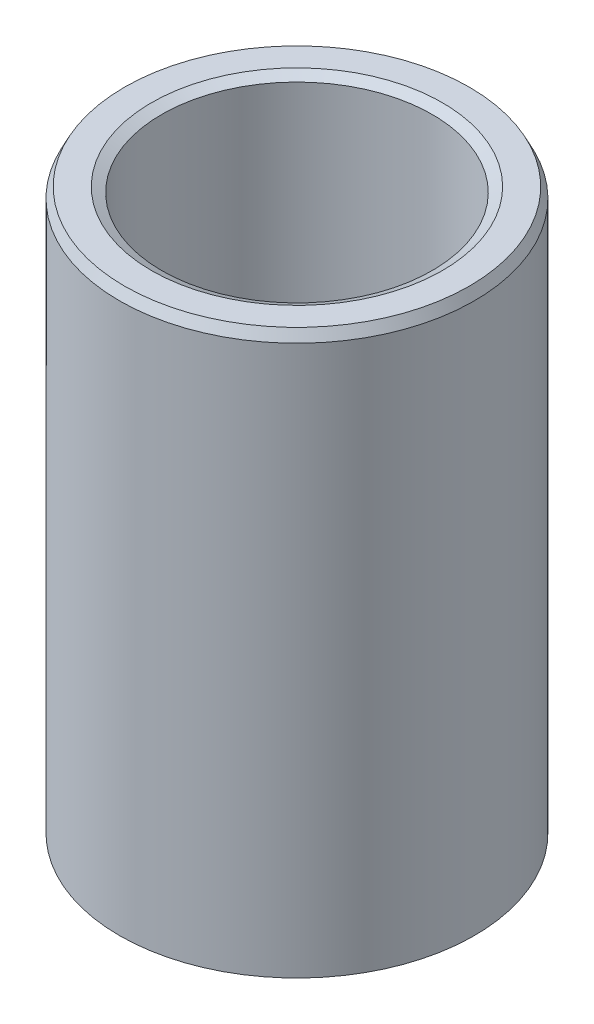
ISO-10303-21;
HEADER;
FILE_DESCRIPTION(('STEP AP214'),'2;1');
FILE_NAME('part.step','',(''),(''),'','','');
FILE_SCHEMA(('AUTOMOTIVE_DESIGN { 1 0 10303 214 1 1 1 1 }'));
ENDSEC;
DATA;
#1=APPLICATION_CONTEXT('core data for automotive mechanical design processes');
#2=APPLICATION_PROTOCOL_DEFINITION('international standard','automotive_design',2000,#1);
#3=PRODUCT_CONTEXT('',#1,'mechanical');
#4=PRODUCT('Part','Part','',(#3));
#5=PRODUCT_RELATED_PRODUCT_CATEGORY('part','',(#4));
#6=PRODUCT_DEFINITION_FORMATION('','',#4);
#7=PRODUCT_DEFINITION_CONTEXT('part definition',#1,'design');
#8=PRODUCT_DEFINITION('design','',#6,#7);
#9=PRODUCT_DEFINITION_SHAPE('','',#8);
#10=(LENGTH_UNIT() NAMED_UNIT(*) SI_UNIT(.MILLI.,.METRE.));
#11=(NAMED_UNIT(*) PLANE_ANGLE_UNIT() SI_UNIT($,.RADIAN.));
#12=(NAMED_UNIT(*) SI_UNIT($,.STERADIAN.) SOLID_ANGLE_UNIT());
#13=UNCERTAINTY_MEASURE_WITH_UNIT(LENGTH_MEASURE(1.E-05),#10,'distance_accuracy_value','');
#14=(GEOMETRIC_REPRESENTATION_CONTEXT(3) GLOBAL_UNCERTAINTY_ASSIGNED_CONTEXT((#13)) GLOBAL_UNIT_ASSIGNED_CONTEXT((#10,
#11,#12)) REPRESENTATION_CONTEXT('',''));
#15=CARTESIAN_POINT('',(0.,0.,0.));
#16=DIRECTION('',(0.,0.,1.));
#17=DIRECTION('',(1.,0.,0.));
#18=AXIS2_PLACEMENT_3D('',#15,#16,#17);
#19=CARTESIAN_POINT('',(0.,79.5943098667342,0.));
#20=DIRECTION('',(0.,-1.,0.));
#21=DIRECTION('',(0.,0.,-1.));
#22=AXIS2_PLACEMENT_3D('',#19,#20,#21);
#23=CYLINDRICAL_SURFACE('',#22,25.);
#24=CARTESIAN_POINT('',(0.,0.715759921933637,0.));
#25=DIRECTION('',(0.,1.,0.));
#26=DIRECTION('',(0.,0.,1.));
#27=AXIS2_PLACEMENT_3D('',#24,#25,#26);
#28=CIRCLE('',#27,25.);
#29=CARTESIAN_POINT('',(0.,0.715759921933637,25.));
#30=VERTEX_POINT('',#29);
#31=EDGE_CURVE('E10',#30,#30,#28,.T.);
#32=ORIENTED_EDGE('',*,*,#31,.T.);
#33=EDGE_LOOP('',(#32));
#34=FACE_BOUND('',#33,.T.);
#35=CARTESIAN_POINT('',(0.,78.1619248431855,0.));
#36=DIRECTION('',(0.,1.,0.));
#37=DIRECTION('',(0.,0.,1.));
#38=AXIS2_PLACEMENT_3D('',#35,#36,#37);
#39=CIRCLE('',#38,25.);
#40=CARTESIAN_POINT('',(0.,78.1619248431855,25.));
#41=VERTEX_POINT('',#40);
#42=EDGE_CURVE('E50',#41,#41,#39,.F.);
#43=ORIENTED_EDGE('',*,*,#42,.T.);
#44=EDGE_LOOP('',(#43));
#45=FACE_BOUND('',#44,.T.);
#46=ADVANCED_FACE('F39',(#34,#45),#23,.T.);
#47=CARTESIAN_POINT('',(0.,79.5943098667342,0.));
#48=DIRECTION('',(0.,1.,0.));
#49=DIRECTION('',(0.,0.,1.));
#50=AXIS2_PLACEMENT_3D('',#47,#48,#49);
#51=PLANE('',#50);
#52=CARTESIAN_POINT('',(0.,79.5943098667342,0.));
#53=DIRECTION('',(0.,1.,0.));
#54=DIRECTION('',(0.,0.,1.));
#55=AXIS2_PLACEMENT_3D('',#52,#53,#54);
#56=CIRCLE('',#55,20.4911713911149);
#57=CARTESIAN_POINT('',(0.,79.5943098667342,20.4911713911149));
#58=VERTEX_POINT('',#57);
#59=EDGE_CURVE('E58',#58,#58,#56,.F.);
#60=ORIENTED_EDGE('',*,*,#59,.T.);
#61=EDGE_LOOP('',(#60));
#62=FACE_BOUND('',#61,.T.);
#63=CARTESIAN_POINT('',(0.,79.5943098667342,0.));
#64=DIRECTION('',(0.,1.,0.));
#65=DIRECTION('',(0.,0.,1.));
#66=AXIS2_PLACEMENT_3D('',#63,#64,#65);
#67=CIRCLE('',#66,24.2842400780664);
#68=CARTESIAN_POINT('',(0.,79.5943098667342,24.2842400780664));
#69=VERTEX_POINT('',#68);
#70=EDGE_CURVE('E61',#69,#69,#67,.T.);
#71=ORIENTED_EDGE('',*,*,#70,.T.);
#72=EDGE_LOOP('',(#71));
#73=FACE_BOUND('',#72,.T.);
#74=ADVANCED_FACE('F88',(#62,#73),#51,.T.);
#75=CARTESIAN_POINT('',(0.,0.,0.));
#76=DIRECTION('',(0.,1.,0.));
#77=DIRECTION('',(0.,0.,1.));
#78=AXIS2_PLACEMENT_3D('',#75,#76,#77);
#79=PLANE('',#78);
#80=CARTESIAN_POINT('',(0.,0.,0.));
#81=DIRECTION('',(0.,1.,0.));
#82=DIRECTION('',(0.,0.,1.));
#83=AXIS2_PLACEMENT_3D('',#80,#81,#82);
#84=CIRCLE('',#83,19.7745462894997);
#85=CARTESIAN_POINT('',(0.,0.,19.7745462894997));
#86=VERTEX_POINT('',#85);
#87=EDGE_CURVE('E51',#86,#86,#84,.T.);
#88=ORIENTED_EDGE('',*,*,#87,.T.);
#89=EDGE_LOOP('',(#88));
#90=FACE_BOUND('',#89,.T.);
#91=CARTESIAN_POINT('',(0.,0.,0.));
#92=DIRECTION('',(0.,1.,0.));
#93=DIRECTION('',(0.,0.,1.));
#94=AXIS2_PLACEMENT_3D('',#91,#92,#93);
#95=CIRCLE('',#94,23.5676149764512);
#96=CARTESIAN_POINT('',(0.,0.,23.5676149764512));
#97=VERTEX_POINT('',#96);
#98=EDGE_CURVE('E54',#97,#97,#95,.F.);
#99=ORIENTED_EDGE('',*,*,#98,.T.);
#100=EDGE_LOOP('',(#99));
#101=FACE_BOUND('',#100,.T.);
#102=ADVANCED_FACE('F83',(#90,#101),#79,.F.);
#103=CARTESIAN_POINT('',(0.,79.5943098667342,0.));
#104=DIRECTION('',(0.,-1.,0.));
#105=DIRECTION('',(0.,0.,-1.));
#106=AXIS2_PLACEMENT_3D('',#103,#104,#105);
#107=CYLINDRICAL_SURFACE('',#106,19.0587863675661);
#108=CARTESIAN_POINT('',(0.,78.8785499448006,0.));
#109=DIRECTION('',(0.,1.,0.));
#110=DIRECTION('',(0.,0.,1.));
#111=AXIS2_PLACEMENT_3D('',#108,#109,#110);
#112=CIRCLE('',#111,19.0587863675661);
#113=CARTESIAN_POINT('',(0.,78.8785499448006,19.0587863675661));
#114=VERTEX_POINT('',#113);
#115=EDGE_CURVE('E67',#114,#114,#112,.T.);
#116=ORIENTED_EDGE('',*,*,#115,.T.);
#117=EDGE_LOOP('',(#116));
#118=FACE_BOUND('',#117,.T.);
#119=CARTESIAN_POINT('',(0.,1.4323850235488,0.));
#120=DIRECTION('',(0.,1.,0.));
#121=DIRECTION('',(0.,0.,1.));
#122=AXIS2_PLACEMENT_3D('',#119,#120,#121);
#123=CIRCLE('',#122,19.0587863675661);
#124=CARTESIAN_POINT('',(0.,1.4323850235488,19.0587863675661));
#125=VERTEX_POINT('',#124);
#126=EDGE_CURVE('E69',#125,#125,#123,.F.);
#127=ORIENTED_EDGE('',*,*,#126,.T.);
#128=EDGE_LOOP('',(#127));
#129=FACE_BOUND('',#128,.T.);
#130=ADVANCED_FACE('F71',(#118,#129),#107,.F.);
#131=CARTESIAN_POINT('',(0.,78.8785499448006,0.));
#132=DIRECTION('',(0.,1.,0.));
#133=DIRECTION('',(0.,0.,1.));
#134=AXIS2_PLACEMENT_3D('',#131,#132,#133);
#135=CONICAL_SURFACE('',#134,19.0587863675661,1.10739035232086);
#136=ORIENTED_EDGE('',*,*,#59,.F.);
#137=EDGE_LOOP('',(#136));
#138=FACE_BOUND('',#137,.T.);
#139=ORIENTED_EDGE('',*,*,#115,.F.);
#140=EDGE_LOOP('',(#139));
#141=FACE_BOUND('',#140,.T.);
#142=ADVANCED_FACE('F77',(#138,#141),#135,.F.);
#143=CARTESIAN_POINT('',(0.,0.,0.));
#144=DIRECTION('',(0.,-1.,0.));
#145=DIRECTION('',(0.,0.,-1.));
#146=AXIS2_PLACEMENT_3D('',#143,#144,#145);
#147=CONICAL_SURFACE('',#146,19.7745462894997,0.463405974474024);
#148=ORIENTED_EDGE('',*,*,#126,.F.);
#149=EDGE_LOOP('',(#148));
#150=FACE_BOUND('',#149,.T.);
#151=ORIENTED_EDGE('',*,*,#87,.F.);
#152=EDGE_LOOP('',(#151));
#153=FACE_BOUND('',#152,.T.);
#154=ADVANCED_FACE('F73',(#150,#153),#147,.F.);
#155=CARTESIAN_POINT('',(0.,0.715759921933637,0.));
#156=DIRECTION('',(0.,1.,0.));
#157=DIRECTION('',(0.,0.,1.));
#158=AXIS2_PLACEMENT_3D('',#155,#156,#157);
#159=CONICAL_SURFACE('',#158,25.,1.10739035232087);
#160=ORIENTED_EDGE('',*,*,#98,.F.);
#161=EDGE_LOOP('',(#160));
#162=FACE_BOUND('',#161,.T.);
#163=ORIENTED_EDGE('',*,*,#31,.F.);
#164=EDGE_LOOP('',(#163));
#165=FACE_BOUND('',#164,.T.);
#166=ADVANCED_FACE('F76',(#162,#165),#159,.T.);
#167=CARTESIAN_POINT('',(0.,79.5943098667342,0.));
#168=DIRECTION('',(0.,-1.,0.));
#169=DIRECTION('',(0.,0.,-1.));
#170=AXIS2_PLACEMENT_3D('',#167,#168,#169);
#171=CONICAL_SURFACE('',#170,24.2842400780664,0.463405974474024);
#172=ORIENTED_EDGE('',*,*,#42,.F.);
#173=EDGE_LOOP('',(#172));
#174=FACE_BOUND('',#173,.T.);
#175=ORIENTED_EDGE('',*,*,#70,.F.);
#176=EDGE_LOOP('',(#175));
#177=FACE_BOUND('',#176,.T.);
#178=ADVANCED_FACE('F45',(#174,#177),#171,.T.);
#179=CLOSED_SHELL('',(#46,#74,#102,#130,#142,#154,#166,#178));
#180=MANIFOLD_SOLID_BREP('B2',#179);
#181=ADVANCED_BREP_SHAPE_REPRESENTATION('',(#18,#180),#14);
#182=SHAPE_DEFINITION_REPRESENTATION(#9,#181);
ENDSEC;
END-ISO-10303-21;
